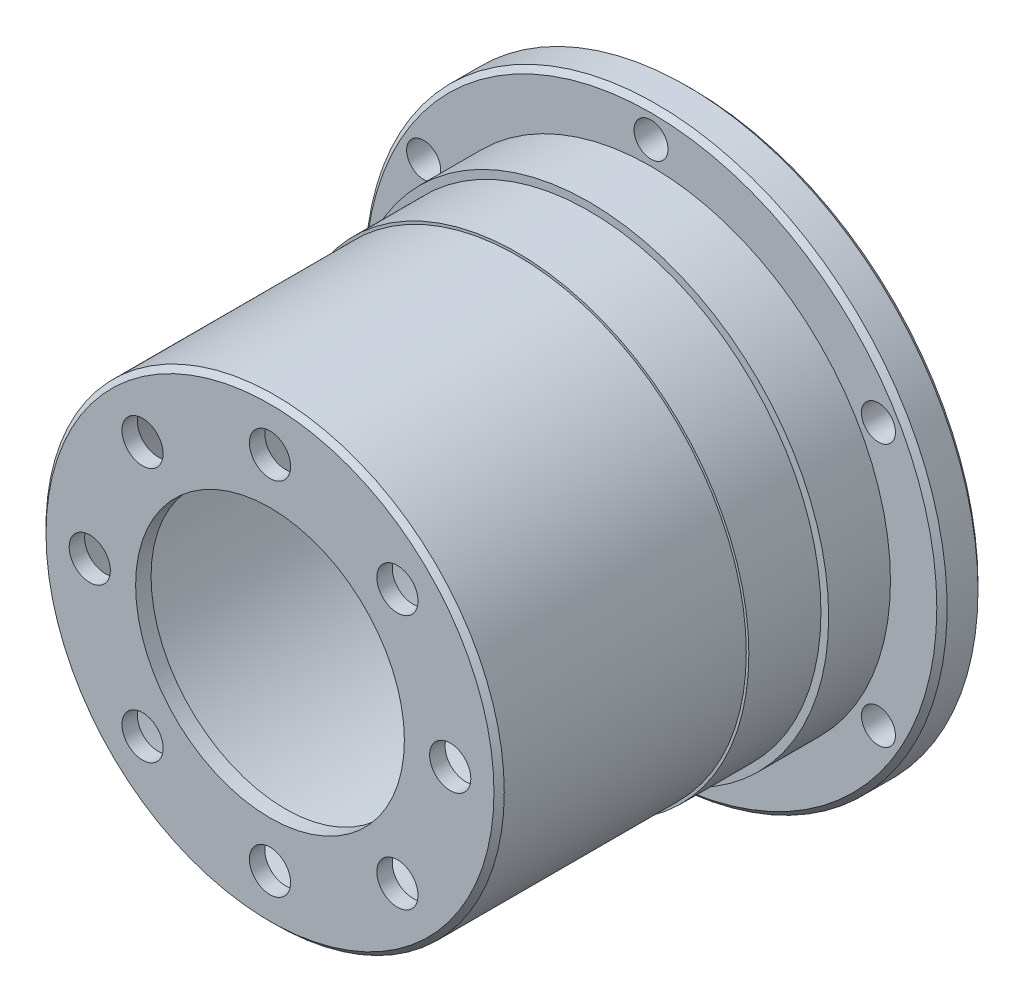
ISO-10303-21;
HEADER;
FILE_DESCRIPTION(('STEP AP214'),'2;1');
FILE_NAME('part.step','',(''),(''),'','','');
FILE_SCHEMA(('AUTOMOTIVE_DESIGN { 1 0 10303 214 1 1 1 1 }'));
ENDSEC;
DATA;
#1=APPLICATION_CONTEXT('core data for automotive mechanical design processes');
#2=APPLICATION_PROTOCOL_DEFINITION('international standard','automotive_design',2000,#1);
#3=PRODUCT_CONTEXT('',#1,'mechanical');
#4=PRODUCT('Part','Part','',(#3));
#5=PRODUCT_RELATED_PRODUCT_CATEGORY('part','',(#4));
#6=PRODUCT_DEFINITION_FORMATION('','',#4);
#7=PRODUCT_DEFINITION_CONTEXT('part definition',#1,'design');
#8=PRODUCT_DEFINITION('design','',#6,#7);
#9=PRODUCT_DEFINITION_SHAPE('','',#8);
#10=(LENGTH_UNIT() NAMED_UNIT(*) SI_UNIT(.MILLI.,.METRE.));
#11=(NAMED_UNIT(*) PLANE_ANGLE_UNIT() SI_UNIT($,.RADIAN.));
#12=(NAMED_UNIT(*) SI_UNIT($,.STERADIAN.) SOLID_ANGLE_UNIT());
#13=UNCERTAINTY_MEASURE_WITH_UNIT(LENGTH_MEASURE(1.E-05),#10,'distance_accuracy_value','');
#14=(GEOMETRIC_REPRESENTATION_CONTEXT(3) GLOBAL_UNCERTAINTY_ASSIGNED_CONTEXT((#13)) GLOBAL_UNIT_ASSIGNED_CONTEXT((#10,
#11,#12)) REPRESENTATION_CONTEXT('',''));
#15=CARTESIAN_POINT('',(0.,0.,0.));
#16=DIRECTION('',(0.,0.,1.));
#17=DIRECTION('',(1.,0.,0.));
#18=AXIS2_PLACEMENT_3D('',#15,#16,#17);
#19=CARTESIAN_POINT('',(0.,0.,10.));
#20=DIRECTION('',(0.,0.,1.));
#21=DIRECTION('',(1.,0.,0.));
#22=AXIS2_PLACEMENT_3D('',#19,#20,#21);
#23=PLANE('',#22);
#24=CARTESIAN_POINT('',(0.,0.,10.));
#25=DIRECTION('',(0.,0.,1.));
#26=DIRECTION('',(1.,0.,0.));
#27=AXIS2_PLACEMENT_3D('',#24,#25,#26);
#28=CIRCLE('',#27,23.25);
#29=CARTESIAN_POINT('',(23.25,0.,10.));
#30=VERTEX_POINT('',#29);
#31=EDGE_CURVE('E96',#30,#30,#28,.T.);
#32=ORIENTED_EDGE('',*,*,#31,.T.);
#33=EDGE_LOOP('',(#32));
#34=FACE_BOUND('',#33,.T.);
#35=CARTESIAN_POINT('',(0.,0.,10.));
#36=DIRECTION('',(0.,0.,1.));
#37=DIRECTION('',(1.,0.,0.));
#38=AXIS2_PLACEMENT_3D('',#35,#36,#37);
#39=CIRCLE('',#38,22.5);
#40=CARTESIAN_POINT('',(22.5,0.,10.));
#41=VERTEX_POINT('',#40);
#42=EDGE_CURVE('E102',#41,#41,#39,.T.);
#43=ORIENTED_EDGE('',*,*,#42,.F.);
#44=EDGE_LOOP('',(#43));
#45=FACE_BOUND('',#44,.T.);
#46=ADVANCED_FACE('F40',(#34,#45),#23,.T.);
#47=CARTESIAN_POINT('',(0.,0.,4.));
#48=DIRECTION('',(0.,0.,-1.));
#49=DIRECTION('',(-1.,0.,0.));
#50=AXIS2_PLACEMENT_3D('',#47,#48,#49);
#51=PLANE('',#50);
#52=CARTESIAN_POINT('',(0.,0.,4.));
#53=DIRECTION('',(0.,0.,-1.));
#54=DIRECTION('',(-1.,0.,0.));
#55=AXIS2_PLACEMENT_3D('',#52,#53,#54);
#56=CIRCLE('',#55,27.75);
#57=CARTESIAN_POINT('',(-27.75,0.,4.));
#58=VERTEX_POINT('',#57);
#59=EDGE_CURVE('E11',#58,#58,#56,.F.);
#60=ORIENTED_EDGE('',*,*,#59,.T.);
#61=EDGE_LOOP('',(#60));
#62=FACE_BOUND('',#61,.T.);
#63=CARTESIAN_POINT('',(22.083647796503,12.7500000000003,4.));
#64=DIRECTION('',(0.,0.,1.));
#65=DIRECTION('',(1.,0.,0.));
#66=AXIS2_PLACEMENT_3D('',#63,#64,#65);
#67=CIRCLE('',#66,1.65);
#68=CARTESIAN_POINT('',(23.733647796503,12.7500000000003,4.));
#69=VERTEX_POINT('',#68);
#70=EDGE_CURVE('E78',#69,#69,#67,.T.);
#71=ORIENTED_EDGE('',*,*,#70,.F.);
#72=EDGE_LOOP('',(#71));
#73=FACE_BOUND('',#72,.T.);
#74=CARTESIAN_POINT('',(22.0836477965033,-12.7499999999998,4.));
#75=DIRECTION('',(0.,0.,1.));
#76=DIRECTION('',(1.,0.,0.));
#77=AXIS2_PLACEMENT_3D('',#74,#75,#76);
#78=CIRCLE('',#77,1.65);
#79=CARTESIAN_POINT('',(23.7336477965033,-12.7499999999998,4.));
#80=VERTEX_POINT('',#79);
#81=EDGE_CURVE('E77',#80,#80,#78,.T.);
#82=ORIENTED_EDGE('',*,*,#81,.F.);
#83=EDGE_LOOP('',(#82));
#84=FACE_BOUND('',#83,.T.);
#85=CARTESIAN_POINT('',(0.,-25.5,4.));
#86=DIRECTION('',(0.,0.,1.));
#87=DIRECTION('',(1.,0.,0.));
#88=AXIS2_PLACEMENT_3D('',#85,#86,#87);
#89=CIRCLE('',#88,1.65);
#90=CARTESIAN_POINT('',(1.65,-25.5,4.));
#91=VERTEX_POINT('',#90);
#92=EDGE_CURVE('E82',#91,#91,#89,.T.);
#93=ORIENTED_EDGE('',*,*,#92,.F.);
#94=EDGE_LOOP('',(#93));
#95=FACE_BOUND('',#94,.T.);
#96=CARTESIAN_POINT('',(-22.0836477965031,-12.7500000000001,4.));
#97=DIRECTION('',(0.,0.,1.));
#98=DIRECTION('',(1.,0.,0.));
#99=AXIS2_PLACEMENT_3D('',#96,#97,#98);
#100=CIRCLE('',#99,1.65);
#101=CARTESIAN_POINT('',(-20.4336477965031,-12.7500000000001,4.));
#102=VERTEX_POINT('',#101);
#103=EDGE_CURVE('E86',#102,#102,#100,.T.);
#104=ORIENTED_EDGE('',*,*,#103,.F.);
#105=EDGE_LOOP('',(#104));
#106=FACE_BOUND('',#105,.T.);
#107=CARTESIAN_POINT('',(-22.0836477965032,12.7499999999999,4.));
#108=DIRECTION('',(0.,0.,1.));
#109=DIRECTION('',(1.,0.,0.));
#110=AXIS2_PLACEMENT_3D('',#107,#108,#109);
#111=CIRCLE('',#110,1.65);
#112=CARTESIAN_POINT('',(-20.4336477965032,12.7499999999999,4.));
#113=VERTEX_POINT('',#112);
#114=EDGE_CURVE('E167',#113,#113,#111,.T.);
#115=ORIENTED_EDGE('',*,*,#114,.F.);
#116=EDGE_LOOP('',(#115));
#117=FACE_BOUND('',#116,.T.);
#118=CARTESIAN_POINT('',(0.,25.5,4.));
#119=DIRECTION('',(0.,0.,1.));
#120=DIRECTION('',(1.,0.,0.));
#121=AXIS2_PLACEMENT_3D('',#118,#119,#120);
#122=CIRCLE('',#121,1.65);
#123=CARTESIAN_POINT('',(1.65,25.5,4.));
#124=VERTEX_POINT('',#123);
#125=EDGE_CURVE('E161',#124,#124,#122,.T.);
#126=ORIENTED_EDGE('',*,*,#125,.F.);
#127=EDGE_LOOP('',(#126));
#128=FACE_BOUND('',#127,.T.);
#129=CARTESIAN_POINT('',(0.,0.,4.));
#130=DIRECTION('',(0.,0.,-1.));
#131=DIRECTION('',(-1.,0.,0.));
#132=AXIS2_PLACEMENT_3D('',#129,#130,#131);
#133=CIRCLE('',#132,23.25);
#134=CARTESIAN_POINT('',(-23.25,0.,4.));
#135=VERTEX_POINT('',#134);
#136=EDGE_CURVE('E73',#135,#135,#133,.F.);
#137=ORIENTED_EDGE('',*,*,#136,.F.);
#138=EDGE_LOOP('',(#137));
#139=FACE_BOUND('',#138,.T.);
#140=ADVANCED_FACE('F185',(#62,#73,#84,#95,#106,#117,#128,#139),#51,.F.);
#141=CARTESIAN_POINT('',(0.,0.,41.));
#142=DIRECTION('',(0.,0.,-1.));
#143=DIRECTION('',(-1.,0.,0.));
#144=AXIS2_PLACEMENT_3D('',#141,#142,#143);
#145=CYLINDRICAL_SURFACE('',#144,22.25);
#146=CARTESIAN_POINT('',(0.,0.,40.5));
#147=DIRECTION('',(0.,0.,1.));
#148=DIRECTION('',(1.,0.,0.));
#149=AXIS2_PLACEMENT_3D('',#146,#147,#148);
#150=CIRCLE('',#149,22.25);
#151=CARTESIAN_POINT('',(22.25,0.,40.5));
#152=VERTEX_POINT('',#151);
#153=EDGE_CURVE('E67',#152,#152,#150,.F.);
#154=ORIENTED_EDGE('',*,*,#153,.T.);
#155=EDGE_LOOP('',(#154));
#156=FACE_BOUND('',#155,.T.);
#157=CARTESIAN_POINT('',(0.,0.,17.));
#158=DIRECTION('',(0.,0.,1.));
#159=DIRECTION('',(1.,0.,0.));
#160=AXIS2_PLACEMENT_3D('',#157,#158,#159);
#161=CIRCLE('',#160,22.25);
#162=CARTESIAN_POINT('',(22.25,0.,17.));
#163=VERTEX_POINT('',#162);
#164=EDGE_CURVE('E105',#163,#163,#161,.T.);
#165=ORIENTED_EDGE('',*,*,#164,.T.);
#166=EDGE_LOOP('',(#165));
#167=FACE_BOUND('',#166,.T.);
#168=ADVANCED_FACE('F188',(#156,#167),#145,.T.);
#169=CARTESIAN_POINT('',(0.,0.,41.));
#170=DIRECTION('',(0.,0.,-1.));
#171=DIRECTION('',(-1.,0.,0.));
#172=AXIS2_PLACEMENT_3D('',#169,#170,#171);
#173=CYLINDRICAL_SURFACE('',#172,21.05);
#174=CARTESIAN_POINT('',(0.,0.,0.500000000000007));
#175=DIRECTION('',(0.,0.,1.));
#176=DIRECTION('',(1.,0.,0.));
#177=AXIS2_PLACEMENT_3D('',#174,#175,#176);
#178=CIRCLE('',#177,21.05);
#179=CARTESIAN_POINT('',(21.05,0.,0.500000000000007));
#180=VERTEX_POINT('',#179);
#181=EDGE_CURVE('E56',#180,#180,#178,.F.);
#182=ORIENTED_EDGE('',*,*,#181,.T.);
#183=EDGE_LOOP('',(#182));
#184=FACE_BOUND('',#183,.T.);
#185=CARTESIAN_POINT('',(0.,0.,39.5));
#186=DIRECTION('',(0.,0.,1.));
#187=DIRECTION('',(1.,0.,0.));
#188=AXIS2_PLACEMENT_3D('',#185,#186,#187);
#189=CIRCLE('',#188,21.05);
#190=CARTESIAN_POINT('',(21.05,0.,39.5));
#191=VERTEX_POINT('',#190);
#192=EDGE_CURVE('E89',#191,#191,#189,.T.);
#193=ORIENTED_EDGE('',*,*,#192,.T.);
#194=EDGE_LOOP('',(#193));
#195=FACE_BOUND('',#194,.T.);
#196=ADVANCED_FACE('F344',(#184,#195),#173,.F.);
#197=CARTESIAN_POINT('',(0.,0.,41.));
#198=DIRECTION('',(0.,0.,1.));
#199=DIRECTION('',(1.,0.,0.));
#200=AXIS2_PLACEMENT_3D('',#197,#198,#199);
#201=PLANE('',#200);
#202=CARTESIAN_POINT('',(0.,0.,41.));
#203=DIRECTION('',(0.,0.,1.));
#204=DIRECTION('',(1.,0.,0.));
#205=AXIS2_PLACEMENT_3D('',#202,#203,#204);
#206=CIRCLE('',#205,21.75);
#207=CARTESIAN_POINT('',(21.75,0.,41.));
#208=VERTEX_POINT('',#207);
#209=EDGE_CURVE('E70',#208,#208,#206,.T.);
#210=ORIENTED_EDGE('',*,*,#209,.T.);
#211=EDGE_LOOP('',(#210));
#212=FACE_BOUND('',#211,.T.);
#213=CARTESIAN_POINT('',(0.,-17.5,41.));
#214=DIRECTION('',(0.,0.,1.));
#215=DIRECTION('',(1.,0.,0.));
#216=AXIS2_PLACEMENT_3D('',#213,#214,#215);
#217=CIRCLE('',#216,2.);
#218=CARTESIAN_POINT('',(2.,-17.5,41.));
#219=VERTEX_POINT('',#218);
#220=EDGE_CURVE('E110',#219,#219,#217,.T.);
#221=ORIENTED_EDGE('',*,*,#220,.F.);
#222=EDGE_LOOP('',(#221));
#223=FACE_BOUND('',#222,.T.);
#224=CARTESIAN_POINT('',(-12.3743686707644,-12.3743686707647,41.));
#225=DIRECTION('',(0.,0.,1.));
#226=DIRECTION('',(1.,0.,0.));
#227=AXIS2_PLACEMENT_3D('',#224,#225,#226);
#228=CIRCLE('',#227,2.);
#229=CARTESIAN_POINT('',(-10.3743686707644,-12.3743686707647,41.));
#230=VERTEX_POINT('',#229);
#231=EDGE_CURVE('E113',#230,#230,#228,.T.);
#232=ORIENTED_EDGE('',*,*,#231,.F.);
#233=EDGE_LOOP('',(#232));
#234=FACE_BOUND('',#233,.T.);
#235=CARTESIAN_POINT('',(-17.5,-1.78676518025611E-13,41.));
#236=DIRECTION('',(0.,0.,1.));
#237=DIRECTION('',(1.,0.,0.));
#238=AXIS2_PLACEMENT_3D('',#235,#236,#237);
#239=CIRCLE('',#238,2.);
#240=CARTESIAN_POINT('',(-15.5,-1.78676518025611E-13,41.));
#241=VERTEX_POINT('',#240);
#242=EDGE_CURVE('E116',#241,#241,#239,.T.);
#243=ORIENTED_EDGE('',*,*,#242,.F.);
#244=EDGE_LOOP('',(#243));
#245=FACE_BOUND('',#244,.T.);
#246=CARTESIAN_POINT('',(12.3743686707646,-12.3743686707646,41.));
#247=DIRECTION('',(0.,0.,1.));
#248=DIRECTION('',(1.,0.,0.));
#249=AXIS2_PLACEMENT_3D('',#246,#247,#248);
#250=CIRCLE('',#249,2.);
#251=CARTESIAN_POINT('',(14.3743686707646,-12.3743686707646,41.));
#252=VERTEX_POINT('',#251);
#253=EDGE_CURVE('E119',#252,#252,#250,.T.);
#254=ORIENTED_EDGE('',*,*,#253,.F.);
#255=EDGE_LOOP('',(#254));
#256=FACE_BOUND('',#255,.T.);
#257=CARTESIAN_POINT('',(17.5,-1.03805852802452E-13,41.));
#258=DIRECTION('',(0.,0.,1.));
#259=DIRECTION('',(1.,0.,0.));
#260=AXIS2_PLACEMENT_3D('',#257,#258,#259);
#261=CIRCLE('',#260,2.00000000000008);
#262=CARTESIAN_POINT('',(19.5000000000001,-1.03805852802452E-13,41.));
#263=VERTEX_POINT('',#262);
#264=EDGE_CURVE('E122',#263,#263,#261,.T.);
#265=ORIENTED_EDGE('',*,*,#264,.F.);
#266=EDGE_LOOP('',(#265));
#267=FACE_BOUND('',#266,.T.);
#268=CARTESIAN_POINT('',(12.3743686707645,12.3743686707646,41.));
#269=DIRECTION('',(0.,0.,1.));
#270=DIRECTION('',(1.,0.,0.));
#271=AXIS2_PLACEMENT_3D('',#268,#269,#270);
#272=CIRCLE('',#271,2.);
#273=CARTESIAN_POINT('',(14.3743686707645,12.3743686707646,41.));
#274=VERTEX_POINT('',#273);
#275=EDGE_CURVE('E125',#274,#274,#272,.T.);
#276=ORIENTED_EDGE('',*,*,#275,.F.);
#277=EDGE_LOOP('',(#276));
#278=FACE_BOUND('',#277,.T.);
#279=CARTESIAN_POINT('',(-1.16226472890446E-13,17.5,41.));
#280=DIRECTION('',(0.,0.,1.));
#281=DIRECTION('',(1.,0.,0.));
#282=AXIS2_PLACEMENT_3D('',#279,#280,#281);
#283=CIRCLE('',#282,2.);
#284=CARTESIAN_POINT('',(1.99999999999989,17.5,41.));
#285=VERTEX_POINT('',#284);
#286=EDGE_CURVE('E128',#285,#285,#283,.T.);
#287=ORIENTED_EDGE('',*,*,#286,.F.);
#288=EDGE_LOOP('',(#287));
#289=FACE_BOUND('',#288,.T.);
#290=CARTESIAN_POINT('',(-12.3743686707645,12.3743686707647,41.));
#291=DIRECTION('',(0.,0.,1.));
#292=DIRECTION('',(1.,0.,0.));
#293=AXIS2_PLACEMENT_3D('',#290,#291,#292);
#294=CIRCLE('',#293,2.);
#295=CARTESIAN_POINT('',(-10.3743686707645,12.3743686707647,41.));
#296=VERTEX_POINT('',#295);
#297=EDGE_CURVE('E131',#296,#296,#294,.T.);
#298=ORIENTED_EDGE('',*,*,#297,.F.);
#299=EDGE_LOOP('',(#298));
#300=FACE_BOUND('',#299,.T.);
#301=CARTESIAN_POINT('',(0.,0.,41.));
#302=DIRECTION('',(0.,0.,1.));
#303=DIRECTION('',(1.,0.,0.));
#304=AXIS2_PLACEMENT_3D('',#301,#302,#303);
#305=CIRCLE('',#304,13.05);
#306=CARTESIAN_POINT('',(13.05,0.,41.));
#307=VERTEX_POINT('',#306);
#308=EDGE_CURVE('E93',#307,#307,#305,.T.);
#309=ORIENTED_EDGE('',*,*,#308,.F.);
#310=EDGE_LOOP('',(#309));
#311=FACE_BOUND('',#310,.T.);
#312=ADVANCED_FACE('F320',(#212,#223,#234,#245,#256,#267,#278,#289,#300,#311),#201,.T.);
#313=CARTESIAN_POINT('',(0.,0.,0.));
#314=DIRECTION('',(0.,0.,1.));
#315=DIRECTION('',(1.,0.,0.));
#316=AXIS2_PLACEMENT_3D('',#313,#314,#315);
#317=PLANE('',#316);
#318=CARTESIAN_POINT('',(0.,0.,0.));
#319=DIRECTION('',(0.,0.,1.));
#320=DIRECTION('',(1.,0.,0.));
#321=AXIS2_PLACEMENT_3D('',#318,#319,#320);
#322=CIRCLE('',#321,21.55);
#323=CARTESIAN_POINT('',(21.55,0.,0.));
#324=VERTEX_POINT('',#323);
#325=EDGE_CURVE('E61',#324,#324,#322,.T.);
#326=ORIENTED_EDGE('',*,*,#325,.T.);
#327=EDGE_LOOP('',(#326));
#328=FACE_BOUND('',#327,.T.);
#329=CARTESIAN_POINT('',(0.,0.,0.));
#330=DIRECTION('',(0.,0.,1.));
#331=DIRECTION('',(1.,0.,0.));
#332=AXIS2_PLACEMENT_3D('',#329,#330,#331);
#333=CIRCLE('',#332,27.75);
#334=CARTESIAN_POINT('',(27.75,0.,0.));
#335=VERTEX_POINT('',#334);
#336=EDGE_CURVE('E64',#335,#335,#333,.F.);
#337=ORIENTED_EDGE('',*,*,#336,.T.);
#338=EDGE_LOOP('',(#337));
#339=FACE_BOUND('',#338,.T.);
#340=CARTESIAN_POINT('',(22.083647796503,12.7500000000003,0.));
#341=DIRECTION('',(0.,0.,1.));
#342=DIRECTION('',(1.,0.,0.));
#343=AXIS2_PLACEMENT_3D('',#340,#341,#342);
#344=CIRCLE('',#343,1.65);
#345=CARTESIAN_POINT('',(23.733647796503,12.7500000000003,0.));
#346=VERTEX_POINT('',#345);
#347=EDGE_CURVE('E74',#346,#346,#344,.T.);
#348=ORIENTED_EDGE('',*,*,#347,.T.);
#349=EDGE_LOOP('',(#348));
#350=FACE_BOUND('',#349,.T.);
#351=CARTESIAN_POINT('',(22.0836477965033,-12.7499999999998,0.));
#352=DIRECTION('',(0.,0.,1.));
#353=DIRECTION('',(1.,0.,0.));
#354=AXIS2_PLACEMENT_3D('',#351,#352,#353);
#355=CIRCLE('',#354,1.65);
#356=CARTESIAN_POINT('',(23.7336477965033,-12.7499999999998,0.));
#357=VERTEX_POINT('',#356);
#358=EDGE_CURVE('E79',#357,#357,#355,.T.);
#359=ORIENTED_EDGE('',*,*,#358,.T.);
#360=EDGE_LOOP('',(#359));
#361=FACE_BOUND('',#360,.T.);
#362=CARTESIAN_POINT('',(0.,-25.5,0.));
#363=DIRECTION('',(0.,0.,1.));
#364=DIRECTION('',(1.,0.,0.));
#365=AXIS2_PLACEMENT_3D('',#362,#363,#364);
#366=CIRCLE('',#365,1.65);
#367=CARTESIAN_POINT('',(1.65,-25.5,0.));
#368=VERTEX_POINT('',#367);
#369=EDGE_CURVE('E83',#368,#368,#366,.T.);
#370=ORIENTED_EDGE('',*,*,#369,.T.);
#371=EDGE_LOOP('',(#370));
#372=FACE_BOUND('',#371,.T.);
#373=CARTESIAN_POINT('',(-22.0836477965031,-12.7500000000001,0.));
#374=DIRECTION('',(0.,0.,1.));
#375=DIRECTION('',(1.,0.,0.));
#376=AXIS2_PLACEMENT_3D('',#373,#374,#375);
#377=CIRCLE('',#376,1.65);
#378=CARTESIAN_POINT('',(-20.4336477965031,-12.7500000000001,0.));
#379=VERTEX_POINT('',#378);
#380=EDGE_CURVE('E170',#379,#379,#377,.T.);
#381=ORIENTED_EDGE('',*,*,#380,.T.);
#382=EDGE_LOOP('',(#381));
#383=FACE_BOUND('',#382,.T.);
#384=CARTESIAN_POINT('',(-22.0836477965032,12.7499999999999,0.));
#385=DIRECTION('',(0.,0.,1.));
#386=DIRECTION('',(1.,0.,0.));
#387=AXIS2_PLACEMENT_3D('',#384,#385,#386);
#388=CIRCLE('',#387,1.65);
#389=CARTESIAN_POINT('',(-20.4336477965032,12.7499999999999,0.));
#390=VERTEX_POINT('',#389);
#391=EDGE_CURVE('E164',#390,#390,#388,.T.);
#392=ORIENTED_EDGE('',*,*,#391,.T.);
#393=EDGE_LOOP('',(#392));
#394=FACE_BOUND('',#393,.T.);
#395=CARTESIAN_POINT('',(0.,25.5,0.));
#396=DIRECTION('',(0.,0.,1.));
#397=DIRECTION('',(1.,0.,0.));
#398=AXIS2_PLACEMENT_3D('',#395,#396,#397);
#399=CIRCLE('',#398,1.65);
#400=CARTESIAN_POINT('',(1.65,25.5,0.));
#401=VERTEX_POINT('',#400);
#402=EDGE_CURVE('E154',#401,#401,#399,.T.);
#403=ORIENTED_EDGE('',*,*,#402,.T.);
#404=EDGE_LOOP('',(#403));
#405=FACE_BOUND('',#404,.T.);
#406=ADVANCED_FACE('F316',(#328,#339,#350,#361,#372,#383,#394,#405),#317,.F.);
#407=CARTESIAN_POINT('',(0.,0.,39.5));
#408=DIRECTION('',(0.,0.,1.));
#409=DIRECTION('',(1.,0.,0.));
#410=AXIS2_PLACEMENT_3D('',#407,#408,#409);
#411=PLANE('',#410);
#412=CARTESIAN_POINT('',(0.,-17.5,39.5));
#413=DIRECTION('',(0.,0.,-1.));
#414=DIRECTION('',(-1.,0.,0.));
#415=AXIS2_PLACEMENT_3D('',#412,#413,#414);
#416=CIRCLE('',#415,2.);
#417=CARTESIAN_POINT('',(-2.00000000000001,-17.5,39.5));
#418=VERTEX_POINT('',#417);
#419=EDGE_CURVE('E144',#418,#418,#416,.T.);
#420=ORIENTED_EDGE('',*,*,#419,.F.);
#421=EDGE_LOOP('',(#420));
#422=FACE_BOUND('',#421,.T.);
#423=CARTESIAN_POINT('',(-12.3743686707644,-12.3743686707647,39.5));
#424=DIRECTION('',(0.,0.,-1.));
#425=DIRECTION('',(-1.,0.,0.));
#426=AXIS2_PLACEMENT_3D('',#423,#424,#425);
#427=CIRCLE('',#426,2.);
#428=CARTESIAN_POINT('',(-14.3743686707644,-12.3743686707647,39.5));
#429=VERTEX_POINT('',#428);
#430=EDGE_CURVE('E141',#429,#429,#427,.T.);
#431=ORIENTED_EDGE('',*,*,#430,.F.);
#432=EDGE_LOOP('',(#431));
#433=FACE_BOUND('',#432,.T.);
#434=CARTESIAN_POINT('',(-17.5,-1.78676518025611E-13,39.5));
#435=DIRECTION('',(0.,0.,-1.));
#436=DIRECTION('',(-1.,0.,0.));
#437=AXIS2_PLACEMENT_3D('',#434,#435,#436);
#438=CIRCLE('',#437,2.);
#439=CARTESIAN_POINT('',(-19.5,-1.78676518025611E-13,39.5));
#440=VERTEX_POINT('',#439);
#441=EDGE_CURVE('E138',#440,#440,#438,.T.);
#442=ORIENTED_EDGE('',*,*,#441,.F.);
#443=EDGE_LOOP('',(#442));
#444=FACE_BOUND('',#443,.T.);
#445=CARTESIAN_POINT('',(12.3743686707646,-12.3743686707646,39.5));
#446=DIRECTION('',(0.,0.,-1.));
#447=DIRECTION('',(-1.,0.,0.));
#448=AXIS2_PLACEMENT_3D('',#445,#446,#447);
#449=CIRCLE('',#448,2.);
#450=CARTESIAN_POINT('',(10.3743686707646,-12.3743686707646,39.5));
#451=VERTEX_POINT('',#450);
#452=EDGE_CURVE('E137',#451,#451,#449,.T.);
#453=ORIENTED_EDGE('',*,*,#452,.F.);
#454=EDGE_LOOP('',(#453));
#455=FACE_BOUND('',#454,.T.);
#456=CARTESIAN_POINT('',(17.5,-1.03805852802452E-13,39.5));
#457=DIRECTION('',(0.,0.,-1.));
#458=DIRECTION('',(-1.,0.,0.));
#459=AXIS2_PLACEMENT_3D('',#456,#457,#458);
#460=CIRCLE('',#459,2.00000000000008);
#461=CARTESIAN_POINT('',(15.4999999999999,-1.03805852802452E-13,39.5));
#462=VERTEX_POINT('',#461);
#463=EDGE_CURVE('E147',#462,#462,#460,.T.);
#464=ORIENTED_EDGE('',*,*,#463,.F.);
#465=EDGE_LOOP('',(#464));
#466=FACE_BOUND('',#465,.T.);
#467=CARTESIAN_POINT('',(12.3743686707645,12.3743686707646,39.5));
#468=DIRECTION('',(0.,0.,-1.));
#469=DIRECTION('',(-1.,0.,0.));
#470=AXIS2_PLACEMENT_3D('',#467,#468,#469);
#471=CIRCLE('',#470,2.);
#472=CARTESIAN_POINT('',(10.3743686707645,12.3743686707646,39.5));
#473=VERTEX_POINT('',#472);
#474=EDGE_CURVE('E153',#473,#473,#471,.T.);
#475=ORIENTED_EDGE('',*,*,#474,.F.);
#476=EDGE_LOOP('',(#475));
#477=FACE_BOUND('',#476,.T.);
#478=CARTESIAN_POINT('',(-1.16226472890446E-13,17.5,39.5));
#479=DIRECTION('',(0.,0.,-1.));
#480=DIRECTION('',(-1.,0.,0.));
#481=AXIS2_PLACEMENT_3D('',#478,#479,#480);
#482=CIRCLE('',#481,2.);
#483=CARTESIAN_POINT('',(-2.00000000000012,17.5,39.5));
#484=VERTEX_POINT('',#483);
#485=EDGE_CURVE('E150',#484,#484,#482,.T.);
#486=ORIENTED_EDGE('',*,*,#485,.F.);
#487=EDGE_LOOP('',(#486));
#488=FACE_BOUND('',#487,.T.);
#489=CARTESIAN_POINT('',(-12.3743686707645,12.3743686707647,39.5));
#490=DIRECTION('',(0.,0.,-1.));
#491=DIRECTION('',(-1.,0.,0.));
#492=AXIS2_PLACEMENT_3D('',#489,#490,#491);
#493=CIRCLE('',#492,2.);
#494=CARTESIAN_POINT('',(-14.3743686707645,12.3743686707647,39.5));
#495=VERTEX_POINT('',#494);
#496=EDGE_CURVE('E134',#495,#495,#493,.T.);
#497=ORIENTED_EDGE('',*,*,#496,.F.);
#498=EDGE_LOOP('',(#497));
#499=FACE_BOUND('',#498,.T.);
#500=CARTESIAN_POINT('',(0.,0.,39.5));
#501=DIRECTION('',(0.,0.,1.));
#502=DIRECTION('',(1.,0.,0.));
#503=AXIS2_PLACEMENT_3D('',#500,#501,#502);
#504=CIRCLE('',#503,13.05);
#505=CARTESIAN_POINT('',(13.05,0.,39.5));
#506=VERTEX_POINT('',#505);
#507=EDGE_CURVE('E92',#506,#506,#504,.T.);
#508=ORIENTED_EDGE('',*,*,#507,.T.);
#509=EDGE_LOOP('',(#508));
#510=FACE_BOUND('',#509,.T.);
#511=ORIENTED_EDGE('',*,*,#192,.F.);
#512=EDGE_LOOP('',(#511));
#513=FACE_BOUND('',#512,.T.);
#514=ADVANCED_FACE('F319',(#422,#433,#444,#455,#466,#477,#488,#499,#510,#513),#411,.F.);
#515=CARTESIAN_POINT('',(0.,0.,39.5));
#516=DIRECTION('',(0.,0.,1.));
#517=DIRECTION('',(1.,0.,0.));
#518=AXIS2_PLACEMENT_3D('',#515,#516,#517);
#519=CYLINDRICAL_SURFACE('',#518,13.05);
#520=ORIENTED_EDGE('',*,*,#507,.F.);
#521=EDGE_LOOP('',(#520));
#522=FACE_BOUND('',#521,.T.);
#523=ORIENTED_EDGE('',*,*,#308,.T.);
#524=EDGE_LOOP('',(#523));
#525=FACE_BOUND('',#524,.T.);
#526=ADVANCED_FACE('F215',(#522,#525),#519,.F.);
#527=CARTESIAN_POINT('',(0.,0.,4.));
#528=DIRECTION('',(0.,0.,-1.));
#529=DIRECTION('',(-1.,0.,0.));
#530=AXIS2_PLACEMENT_3D('',#527,#528,#529);
#531=CYLINDRICAL_SURFACE('',#530,28.25);
#532=CARTESIAN_POINT('',(0.,0.,0.5));
#533=DIRECTION('',(0.,0.,1.));
#534=DIRECTION('',(1.,0.,0.));
#535=AXIS2_PLACEMENT_3D('',#532,#533,#534);
#536=CIRCLE('',#535,28.25);
#537=CARTESIAN_POINT('',(28.25,0.,0.5));
#538=VERTEX_POINT('',#537);
#539=EDGE_CURVE('E48',#538,#538,#536,.T.);
#540=ORIENTED_EDGE('',*,*,#539,.T.);
#541=EDGE_LOOP('',(#540));
#542=FACE_BOUND('',#541,.T.);
#543=CARTESIAN_POINT('',(0.,0.,3.49999999999999));
#544=DIRECTION('',(0.,0.,-1.));
#545=DIRECTION('',(-1.,0.,0.));
#546=AXIS2_PLACEMENT_3D('',#543,#544,#545);
#547=CIRCLE('',#546,28.25);
#548=CARTESIAN_POINT('',(-28.25,0.,3.49999999999999));
#549=VERTEX_POINT('',#548);
#550=EDGE_CURVE('E52',#549,#549,#547,.T.);
#551=ORIENTED_EDGE('',*,*,#550,.T.);
#552=EDGE_LOOP('',(#551));
#553=FACE_BOUND('',#552,.T.);
#554=ADVANCED_FACE('F205',(#542,#553),#531,.T.);
#555=CARTESIAN_POINT('',(0.,0.,10.));
#556=DIRECTION('',(0.,0.,-1.));
#557=DIRECTION('',(-1.,0.,0.));
#558=AXIS2_PLACEMENT_3D('',#555,#556,#557);
#559=CYLINDRICAL_SURFACE('',#558,23.25);
#560=ORIENTED_EDGE('',*,*,#31,.F.);
#561=EDGE_LOOP('',(#560));
#562=FACE_BOUND('',#561,.T.);
#563=ORIENTED_EDGE('',*,*,#136,.T.);
#564=EDGE_LOOP('',(#563));
#565=FACE_BOUND('',#564,.T.);
#566=ADVANCED_FACE('F202',(#562,#565),#559,.T.);
#567=CARTESIAN_POINT('',(0.,0.,17.));
#568=DIRECTION('',(0.,0.,1.));
#569=DIRECTION('',(1.,0.,0.));
#570=AXIS2_PLACEMENT_3D('',#567,#568,#569);
#571=PLANE('',#570);
#572=CARTESIAN_POINT('',(0.,0.,17.));
#573=DIRECTION('',(0.,0.,1.));
#574=DIRECTION('',(1.,0.,0.));
#575=AXIS2_PLACEMENT_3D('',#572,#573,#574);
#576=CIRCLE('',#575,22.5);
#577=CARTESIAN_POINT('',(22.5,0.,17.));
#578=VERTEX_POINT('',#577);
#579=EDGE_CURVE('E101',#578,#578,#576,.T.);
#580=ORIENTED_EDGE('',*,*,#579,.T.);
#581=EDGE_LOOP('',(#580));
#582=FACE_BOUND('',#581,.T.);
#583=ORIENTED_EDGE('',*,*,#164,.F.);
#584=EDGE_LOOP('',(#583));
#585=FACE_BOUND('',#584,.T.);
#586=ADVANCED_FACE('F204',(#582,#585),#571,.T.);
#587=CARTESIAN_POINT('',(0.,0.,17.));
#588=DIRECTION('',(0.,0.,-1.));
#589=DIRECTION('',(-1.,0.,0.));
#590=AXIS2_PLACEMENT_3D('',#587,#588,#589);
#591=CYLINDRICAL_SURFACE('',#590,22.5);
#592=ORIENTED_EDGE('',*,*,#579,.F.);
#593=EDGE_LOOP('',(#592));
#594=FACE_BOUND('',#593,.T.);
#595=ORIENTED_EDGE('',*,*,#42,.T.);
#596=EDGE_LOOP('',(#595));
#597=FACE_BOUND('',#596,.T.);
#598=ADVANCED_FACE('F212',(#594,#597),#591,.T.);
#599=CARTESIAN_POINT('',(-12.3743686707645,12.3743686707647,46.5));
#600=DIRECTION('',(0.,0.,-1.));
#601=DIRECTION('',(-1.,0.,0.));
#602=AXIS2_PLACEMENT_3D('',#599,#600,#601);
#603=CYLINDRICAL_SURFACE('',#602,2.);
#604=ORIENTED_EDGE('',*,*,#297,.T.);
#605=EDGE_LOOP('',(#604));
#606=FACE_BOUND('',#605,.T.);
#607=ORIENTED_EDGE('',*,*,#496,.T.);
#608=EDGE_LOOP('',(#607));
#609=FACE_BOUND('',#608,.T.);
#610=ADVANCED_FACE('F226',(#606,#609),#603,.F.);
#611=CARTESIAN_POINT('',(-1.16226472890446E-13,17.5,46.5));
#612=DIRECTION('',(0.,0.,-1.));
#613=DIRECTION('',(-1.,0.,0.));
#614=AXIS2_PLACEMENT_3D('',#611,#612,#613);
#615=CYLINDRICAL_SURFACE('',#614,2.);
#616=ORIENTED_EDGE('',*,*,#286,.T.);
#617=EDGE_LOOP('',(#616));
#618=FACE_BOUND('',#617,.T.);
#619=ORIENTED_EDGE('',*,*,#485,.T.);
#620=EDGE_LOOP('',(#619));
#621=FACE_BOUND('',#620,.T.);
#622=ADVANCED_FACE('F231',(#618,#621),#615,.F.);
#623=CARTESIAN_POINT('',(12.3743686707645,12.3743686707646,46.5));
#624=DIRECTION('',(0.,0.,-1.));
#625=DIRECTION('',(-1.,0.,0.));
#626=AXIS2_PLACEMENT_3D('',#623,#624,#625);
#627=CYLINDRICAL_SURFACE('',#626,2.);
#628=ORIENTED_EDGE('',*,*,#275,.T.);
#629=EDGE_LOOP('',(#628));
#630=FACE_BOUND('',#629,.T.);
#631=ORIENTED_EDGE('',*,*,#474,.T.);
#632=EDGE_LOOP('',(#631));
#633=FACE_BOUND('',#632,.T.);
#634=ADVANCED_FACE('F253',(#630,#633),#627,.F.);
#635=CARTESIAN_POINT('',(17.5,-1.03805852802452E-13,46.5));
#636=DIRECTION('',(0.,0.,-1.));
#637=DIRECTION('',(-1.,0.,0.));
#638=AXIS2_PLACEMENT_3D('',#635,#636,#637);
#639=CYLINDRICAL_SURFACE('',#638,2.00000000000008);
#640=ORIENTED_EDGE('',*,*,#264,.T.);
#641=EDGE_LOOP('',(#640));
#642=FACE_BOUND('',#641,.T.);
#643=ORIENTED_EDGE('',*,*,#463,.T.);
#644=EDGE_LOOP('',(#643));
#645=FACE_BOUND('',#644,.T.);
#646=ADVANCED_FACE('F241',(#642,#645),#639,.F.);
#647=CARTESIAN_POINT('',(12.3743686707646,-12.3743686707646,46.5));
#648=DIRECTION('',(0.,0.,-1.));
#649=DIRECTION('',(-1.,0.,0.));
#650=AXIS2_PLACEMENT_3D('',#647,#648,#649);
#651=CYLINDRICAL_SURFACE('',#650,2.);
#652=ORIENTED_EDGE('',*,*,#253,.T.);
#653=EDGE_LOOP('',(#652));
#654=FACE_BOUND('',#653,.T.);
#655=ORIENTED_EDGE('',*,*,#452,.T.);
#656=EDGE_LOOP('',(#655));
#657=FACE_BOUND('',#656,.T.);
#658=ADVANCED_FACE('F237',(#654,#657),#651,.F.);
#659=CARTESIAN_POINT('',(-17.5,-1.78676518025611E-13,46.5));
#660=DIRECTION('',(0.,0.,-1.));
#661=DIRECTION('',(-1.,0.,0.));
#662=AXIS2_PLACEMENT_3D('',#659,#660,#661);
#663=CYLINDRICAL_SURFACE('',#662,2.);
#664=ORIENTED_EDGE('',*,*,#242,.T.);
#665=EDGE_LOOP('',(#664));
#666=FACE_BOUND('',#665,.T.);
#667=ORIENTED_EDGE('',*,*,#441,.T.);
#668=EDGE_LOOP('',(#667));
#669=FACE_BOUND('',#668,.T.);
#670=ADVANCED_FACE('F233',(#666,#669),#663,.F.);
#671=CARTESIAN_POINT('',(-12.3743686707644,-12.3743686707647,46.5));
#672=DIRECTION('',(0.,0.,-1.));
#673=DIRECTION('',(-1.,0.,0.));
#674=AXIS2_PLACEMENT_3D('',#671,#672,#673);
#675=CYLINDRICAL_SURFACE('',#674,2.);
#676=ORIENTED_EDGE('',*,*,#231,.T.);
#677=EDGE_LOOP('',(#676));
#678=FACE_BOUND('',#677,.T.);
#679=ORIENTED_EDGE('',*,*,#430,.T.);
#680=EDGE_LOOP('',(#679));
#681=FACE_BOUND('',#680,.T.);
#682=ADVANCED_FACE('F236',(#678,#681),#675,.F.);
#683=CARTESIAN_POINT('',(0.,-17.5,46.5));
#684=DIRECTION('',(0.,0.,-1.));
#685=DIRECTION('',(-1.,0.,0.));
#686=AXIS2_PLACEMENT_3D('',#683,#684,#685);
#687=CYLINDRICAL_SURFACE('',#686,2.);
#688=ORIENTED_EDGE('',*,*,#220,.T.);
#689=EDGE_LOOP('',(#688));
#690=FACE_BOUND('',#689,.T.);
#691=ORIENTED_EDGE('',*,*,#419,.T.);
#692=EDGE_LOOP('',(#691));
#693=FACE_BOUND('',#692,.T.);
#694=ADVANCED_FACE('F243',(#690,#693),#687,.F.);
#695=CARTESIAN_POINT('',(0.,25.5,4.));
#696=DIRECTION('',(0.,0.,1.));
#697=DIRECTION('',(1.,0.,0.));
#698=AXIS2_PLACEMENT_3D('',#695,#696,#697);
#699=CYLINDRICAL_SURFACE('',#698,1.65);
#700=ORIENTED_EDGE('',*,*,#125,.T.);
#701=EDGE_LOOP('',(#700));
#702=FACE_BOUND('',#701,.T.);
#703=ORIENTED_EDGE('',*,*,#402,.F.);
#704=EDGE_LOOP('',(#703));
#705=FACE_BOUND('',#704,.T.);
#706=ADVANCED_FACE('F246',(#702,#705),#699,.F.);
#707=CARTESIAN_POINT('',(-22.0836477965032,12.7499999999999,4.));
#708=DIRECTION('',(0.,0.,1.));
#709=DIRECTION('',(1.,0.,0.));
#710=AXIS2_PLACEMENT_3D('',#707,#708,#709);
#711=CYLINDRICAL_SURFACE('',#710,1.65);
#712=ORIENTED_EDGE('',*,*,#114,.T.);
#713=EDGE_LOOP('',(#712));
#714=FACE_BOUND('',#713,.T.);
#715=ORIENTED_EDGE('',*,*,#391,.F.);
#716=EDGE_LOOP('',(#715));
#717=FACE_BOUND('',#716,.T.);
#718=ADVANCED_FACE('F263',(#714,#717),#711,.F.);
#719=CARTESIAN_POINT('',(-22.0836477965031,-12.7500000000001,4.));
#720=DIRECTION('',(0.,0.,1.));
#721=DIRECTION('',(1.,0.,0.));
#722=AXIS2_PLACEMENT_3D('',#719,#720,#721);
#723=CYLINDRICAL_SURFACE('',#722,1.65);
#724=ORIENTED_EDGE('',*,*,#103,.T.);
#725=EDGE_LOOP('',(#724));
#726=FACE_BOUND('',#725,.T.);
#727=ORIENTED_EDGE('',*,*,#380,.F.);
#728=EDGE_LOOP('',(#727));
#729=FACE_BOUND('',#728,.T.);
#730=ADVANCED_FACE('F267',(#726,#729),#723,.F.);
#731=CARTESIAN_POINT('',(0.,-25.5,4.));
#732=DIRECTION('',(0.,0.,1.));
#733=DIRECTION('',(1.,0.,0.));
#734=AXIS2_PLACEMENT_3D('',#731,#732,#733);
#735=CYLINDRICAL_SURFACE('',#734,1.65);
#736=ORIENTED_EDGE('',*,*,#92,.T.);
#737=EDGE_LOOP('',(#736));
#738=FACE_BOUND('',#737,.T.);
#739=ORIENTED_EDGE('',*,*,#369,.F.);
#740=EDGE_LOOP('',(#739));
#741=FACE_BOUND('',#740,.T.);
#742=ADVANCED_FACE('F271',(#738,#741),#735,.F.);
#743=CARTESIAN_POINT('',(22.0836477965033,-12.7499999999998,4.));
#744=DIRECTION('',(0.,0.,1.));
#745=DIRECTION('',(1.,0.,0.));
#746=AXIS2_PLACEMENT_3D('',#743,#744,#745);
#747=CYLINDRICAL_SURFACE('',#746,1.65);
#748=ORIENTED_EDGE('',*,*,#81,.T.);
#749=EDGE_LOOP('',(#748));
#750=FACE_BOUND('',#749,.T.);
#751=ORIENTED_EDGE('',*,*,#358,.F.);
#752=EDGE_LOOP('',(#751));
#753=FACE_BOUND('',#752,.T.);
#754=ADVANCED_FACE('F275',(#750,#753),#747,.F.);
#755=CARTESIAN_POINT('',(22.083647796503,12.7500000000003,4.));
#756=DIRECTION('',(0.,0.,1.));
#757=DIRECTION('',(1.,0.,0.));
#758=AXIS2_PLACEMENT_3D('',#755,#756,#757);
#759=CYLINDRICAL_SURFACE('',#758,1.65);
#760=ORIENTED_EDGE('',*,*,#70,.T.);
#761=EDGE_LOOP('',(#760));
#762=FACE_BOUND('',#761,.T.);
#763=ORIENTED_EDGE('',*,*,#347,.F.);
#764=EDGE_LOOP('',(#763));
#765=FACE_BOUND('',#764,.T.);
#766=ADVANCED_FACE('F182',(#762,#765),#759,.F.);
#767=CARTESIAN_POINT('',(0.,0.,41.));
#768=DIRECTION('',(0.,0.,-1.));
#769=DIRECTION('',(-1.,0.,0.));
#770=AXIS2_PLACEMENT_3D('',#767,#768,#769);
#771=CONICAL_SURFACE('',#770,21.75,0.785398163397431);
#772=ORIENTED_EDGE('',*,*,#153,.F.);
#773=EDGE_LOOP('',(#772));
#774=FACE_BOUND('',#773,.T.);
#775=ORIENTED_EDGE('',*,*,#209,.F.);
#776=EDGE_LOOP('',(#775));
#777=FACE_BOUND('',#776,.T.);
#778=ADVANCED_FACE('F281',(#774,#777),#771,.T.);
#779=CARTESIAN_POINT('',(0.,0.,0.));
#780=DIRECTION('',(0.,0.,-1.));
#781=DIRECTION('',(-1.,0.,0.));
#782=AXIS2_PLACEMENT_3D('',#779,#780,#781);
#783=CONICAL_SURFACE('',#782,21.55,0.785398163397441);
#784=ORIENTED_EDGE('',*,*,#181,.F.);
#785=EDGE_LOOP('',(#784));
#786=FACE_BOUND('',#785,.T.);
#787=ORIENTED_EDGE('',*,*,#325,.F.);
#788=EDGE_LOOP('',(#787));
#789=FACE_BOUND('',#788,.T.);
#790=ADVANCED_FACE('F285',(#786,#789),#783,.F.);
#791=CARTESIAN_POINT('',(0.,0.,0.));
#792=DIRECTION('',(0.,0.,1.));
#793=DIRECTION('',(1.,0.,0.));
#794=AXIS2_PLACEMENT_3D('',#791,#792,#793);
#795=CONICAL_SURFACE('',#794,27.75,0.785398163397435);
#796=ORIENTED_EDGE('',*,*,#539,.F.);
#797=EDGE_LOOP('',(#796));
#798=FACE_BOUND('',#797,.T.);
#799=ORIENTED_EDGE('',*,*,#336,.F.);
#800=EDGE_LOOP('',(#799));
#801=FACE_BOUND('',#800,.T.);
#802=ADVANCED_FACE('F291',(#798,#801),#795,.T.);
#803=CARTESIAN_POINT('',(0.,0.,3.49999999999999));
#804=DIRECTION('',(0.,0.,-1.));
#805=DIRECTION('',(-1.,0.,0.));
#806=AXIS2_PLACEMENT_3D('',#803,#804,#805);
#807=CONICAL_SURFACE('',#806,28.25,0.785398163397448);
#808=ORIENTED_EDGE('',*,*,#59,.F.);
#809=EDGE_LOOP('',(#808));
#810=FACE_BOUND('',#809,.T.);
#811=ORIENTED_EDGE('',*,*,#550,.F.);
#812=EDGE_LOOP('',(#811));
#813=FACE_BOUND('',#812,.T.);
#814=ADVANCED_FACE('F43',(#810,#813),#807,.T.);
#815=CLOSED_SHELL('',(#46,#140,#168,#196,#312,#406,#514,#526,#554,#566,#586,#598,#610,#622,#634,
#646,#658,#670,#682,#694,#706,#718,#730,#742,#754,#766,#778,#790,#802,#814));
#816=MANIFOLD_SOLID_BREP('B2',#815);
#817=ADVANCED_BREP_SHAPE_REPRESENTATION('',(#18,#816),#14);
#818=SHAPE_DEFINITION_REPRESENTATION(#9,#817);
ENDSEC;
END-ISO-10303-21;
